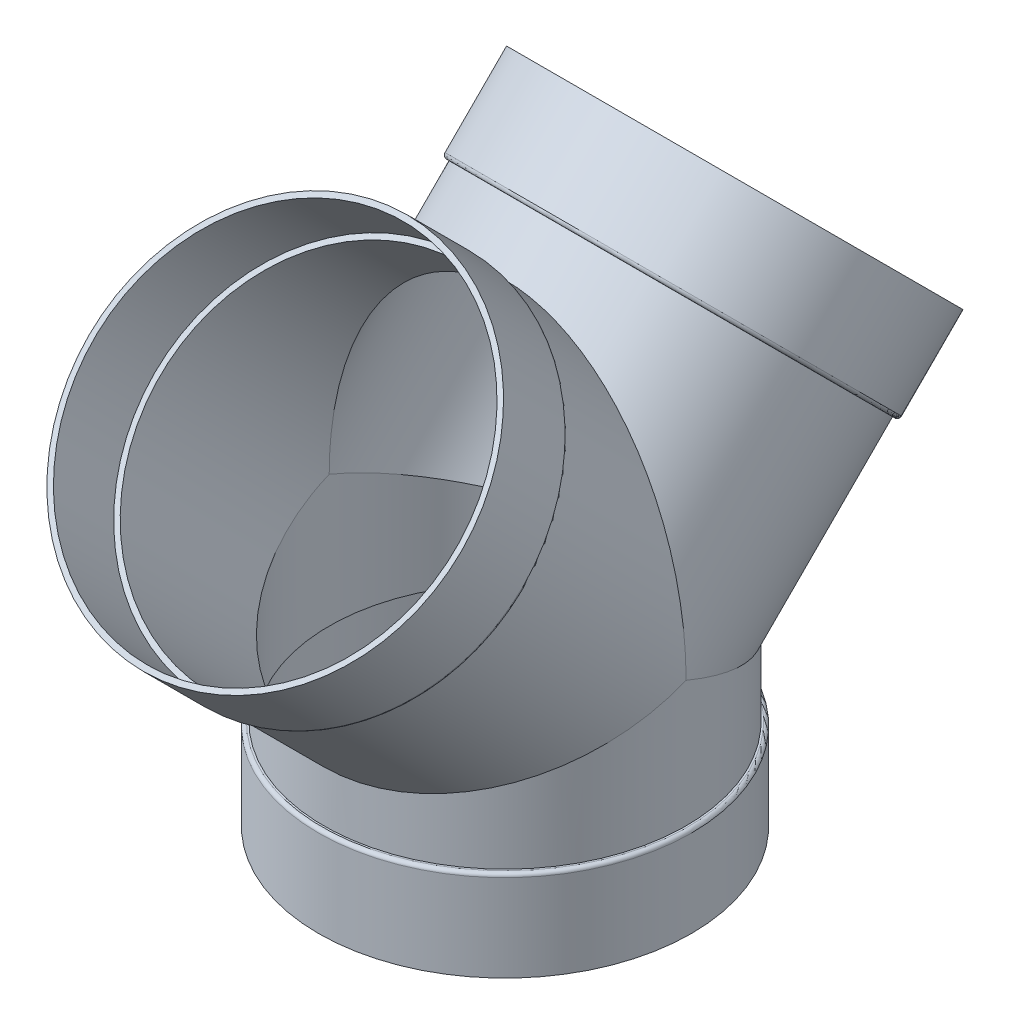
ISO-10303-21;
HEADER;
FILE_DESCRIPTION(('STEP AP214'),'2;1');
FILE_NAME('part.step','',(''),(''),'','','');
FILE_SCHEMA(('AUTOMOTIVE_DESIGN { 1 0 10303 214 1 1 1 1 }'));
ENDSEC;
DATA;
#1=APPLICATION_CONTEXT('core data for automotive mechanical design processes');
#2=APPLICATION_PROTOCOL_DEFINITION('international standard','automotive_design',2000,#1);
#3=PRODUCT_CONTEXT('',#1,'mechanical');
#4=PRODUCT('Part','Part','',(#3));
#5=PRODUCT_RELATED_PRODUCT_CATEGORY('part','',(#4));
#6=PRODUCT_DEFINITION_FORMATION('','',#4);
#7=PRODUCT_DEFINITION_CONTEXT('part definition',#1,'design');
#8=PRODUCT_DEFINITION('design','',#6,#7);
#9=PRODUCT_DEFINITION_SHAPE('','',#8);
#10=(LENGTH_UNIT() NAMED_UNIT(*) SI_UNIT(.MILLI.,.METRE.));
#11=(NAMED_UNIT(*) PLANE_ANGLE_UNIT() SI_UNIT($,.RADIAN.));
#12=(NAMED_UNIT(*) SI_UNIT($,.STERADIAN.) SOLID_ANGLE_UNIT());
#13=UNCERTAINTY_MEASURE_WITH_UNIT(LENGTH_MEASURE(1.E-05),#10,'distance_accuracy_value','');
#14=(GEOMETRIC_REPRESENTATION_CONTEXT(3) GLOBAL_UNCERTAINTY_ASSIGNED_CONTEXT((#13)) GLOBAL_UNIT_ASSIGNED_CONTEXT((#10,
#11,#12)) REPRESENTATION_CONTEXT('',''));
#15=CARTESIAN_POINT('',(0.,0.,0.));
#16=DIRECTION('',(0.,0.,1.));
#17=DIRECTION('',(1.,0.,0.));
#18=AXIS2_PLACEMENT_3D('',#15,#16,#17);
#19=CARTESIAN_POINT('',(0.,-52.1137931034483,0.));
#20=DIRECTION('',(0.,-1.,0.));
#21=DIRECTION('',(0.,0.,-1.));
#22=AXIS2_PLACEMENT_3D('',#19,#20,#21);
#23=CYLINDRICAL_SURFACE('',#22,161.925);
#24=CARTESIAN_POINT('',(0.,80.9625,0.));
#25=DIRECTION('',(0.,-1.,0.));
#26=DIRECTION('',(0.,0.,-1.));
#27=AXIS2_PLACEMENT_3D('',#24,#25,#26);
#28=CIRCLE('',#27,161.925);
#29=CARTESIAN_POINT('',(0.,80.9625,-161.925));
#30=VERTEX_POINT('',#29);
#31=EDGE_CURVE('E142',#30,#30,#28,.T.);
#32=ORIENTED_EDGE('',*,*,#31,.F.);
#33=EDGE_LOOP('',(#32));
#34=FACE_BOUND('',#33,.T.);
#35=CARTESIAN_POINT('',(0.,193.675,0.));
#36=DIRECTION('',(0.,0.923879532511286,-0.38268343236509));
#37=DIRECTION('',(0.,-0.382683432365091,-0.923879532511287));
#38=AXIS2_PLACEMENT_3D('',#35,#36,#37);
#39=ELLIPSE('',#38,175.266357032346,161.925);
#40=CARTESIAN_POINT('',(161.925,193.675,0.));
#41=VERTEX_POINT('',#40);
#42=CARTESIAN_POINT('',(-161.925,193.675,0.));
#43=VERTEX_POINT('',#42);
#44=EDGE_CURVE('E61',#41,#43,#39,.T.);
#45=ORIENTED_EDGE('',*,*,#44,.F.);
#46=CARTESIAN_POINT('',(0.,193.675,0.));
#47=DIRECTION('',(0.,0.923879532511286,0.38268343236509));
#48=DIRECTION('',(0.,-0.38268343236509,0.923879532511287));
#49=AXIS2_PLACEMENT_3D('',#46,#47,#48);
#50=ELLIPSE('',#49,175.266357032346,161.925);
#51=EDGE_CURVE('E148',#43,#41,#50,.T.);
#52=ORIENTED_EDGE('',*,*,#51,.F.);
#53=EDGE_LOOP('',(#45,#52));
#54=FACE_BOUND('',#53,.T.);
#55=ADVANCED_FACE('F43',(#34,#54),#23,.T.);
#56=CARTESIAN_POINT('',(0.,80.9625,166.6875));
#57=DIRECTION('',(0.,-1.,0.));
#58=DIRECTION('',(0.,0.,-1.));
#59=AXIS2_PLACEMENT_3D('',#56,#57,#58);
#60=PLANE('',#59);
#61=CARTESIAN_POINT('',(0.,80.9625,0.));
#62=DIRECTION('',(0.,-1.,0.));
#63=DIRECTION('',(0.,0.,-1.));
#64=AXIS2_PLACEMENT_3D('',#61,#62,#63);
#65=CIRCLE('',#64,163.5125);
#66=CARTESIAN_POINT('',(0.,80.9625,-163.5125));
#67=VERTEX_POINT('',#66);
#68=EDGE_CURVE('E158',#67,#67,#65,.F.);
#69=ORIENTED_EDGE('',*,*,#68,.T.);
#70=EDGE_LOOP('',(#69));
#71=FACE_BOUND('',#70,.T.);
#72=ORIENTED_EDGE('',*,*,#31,.T.);
#73=EDGE_LOOP('',(#72));
#74=FACE_BOUND('',#73,.T.);
#75=ADVANCED_FACE('F188',(#71,#74),#60,.F.);
#76=CARTESIAN_POINT('',(0.,-52.1137931034483,0.));
#77=DIRECTION('',(0.,-1.,0.));
#78=DIRECTION('',(0.,0.,-1.));
#79=AXIS2_PLACEMENT_3D('',#76,#77,#78);
#80=CYLINDRICAL_SURFACE('',#79,166.6875);
#81=CARTESIAN_POINT('',(0.,77.7875,0.));
#82=DIRECTION('',(0.,-1.,0.));
#83=DIRECTION('',(0.,0.,-1.));
#84=AXIS2_PLACEMENT_3D('',#81,#82,#83);
#85=CIRCLE('',#84,166.6875);
#86=CARTESIAN_POINT('',(0.,77.7875,-166.6875));
#87=VERTEX_POINT('',#86);
#88=EDGE_CURVE('E154',#87,#87,#85,.T.);
#89=ORIENTED_EDGE('',*,*,#88,.T.);
#90=EDGE_LOOP('',(#89));
#91=FACE_BOUND('',#90,.T.);
#92=CARTESIAN_POINT('',(0.,0.,0.));
#93=DIRECTION('',(0.,-1.,0.));
#94=DIRECTION('',(0.,0.,-1.));
#95=AXIS2_PLACEMENT_3D('',#92,#93,#94);
#96=CIRCLE('',#95,166.6875);
#97=CARTESIAN_POINT('',(0.,0.,-166.6875));
#98=VERTEX_POINT('',#97);
#99=EDGE_CURVE('E138',#98,#98,#96,.T.);
#100=ORIENTED_EDGE('',*,*,#99,.F.);
#101=EDGE_LOOP('',(#100));
#102=FACE_BOUND('',#101,.T.);
#103=ADVANCED_FACE('F194',(#91,#102),#80,.T.);
#104=CARTESIAN_POINT('',(0.,0.,166.6875));
#105=DIRECTION('',(0.,1.,0.));
#106=DIRECTION('',(0.,0.,1.));
#107=AXIS2_PLACEMENT_3D('',#104,#105,#106);
#108=PLANE('',#107);
#109=CARTESIAN_POINT('',(0.,0.,0.));
#110=DIRECTION('',(0.,1.,0.));
#111=DIRECTION('',(0.,0.,1.));
#112=AXIS2_PLACEMENT_3D('',#109,#110,#111);
#113=CIRCLE('',#112,161.925);
#114=CARTESIAN_POINT('',(0.,0.,161.925));
#115=VERTEX_POINT('',#114);
#116=EDGE_CURVE('E117',#115,#115,#113,.F.);
#117=ORIENTED_EDGE('',*,*,#116,.F.);
#118=EDGE_LOOP('',(#117));
#119=FACE_BOUND('',#118,.T.);
#120=ORIENTED_EDGE('',*,*,#99,.T.);
#121=EDGE_LOOP('',(#120));
#122=FACE_BOUND('',#121,.T.);
#123=ADVANCED_FACE('F215',(#119,#122),#108,.F.);
#124=CARTESIAN_POINT('',(0.,281.232497180424,-323.28922035849));
#125=DIRECTION('',(0.,0.707106781186547,-0.707106781186548));
#126=DIRECTION('',(0.,0.707106781186548,0.707106781186547));
#127=AXIS2_PLACEMENT_3D('',#124,#125,#126);
#128=PLANE('',#127);
#129=CARTESIAN_POINT('',(0.,399.098358769457,-205.423358769457));
#130=DIRECTION('',(0.,0.707106781186547,-0.707106781186548));
#131=DIRECTION('',(0.,0.707106781186548,0.707106781186547));
#132=AXIS2_PLACEMENT_3D('',#129,#130,#131);
#133=CIRCLE('',#132,161.925);
#134=CARTESIAN_POINT('',(0.,513.596624313088,-90.9250932258256));
#135=VERTEX_POINT('',#134);
#136=EDGE_CURVE('E108',#135,#135,#133,.F.);
#137=ORIENTED_EDGE('',*,*,#136,.T.);
#138=EDGE_LOOP('',(#137));
#139=FACE_BOUND('',#138,.T.);
#140=CARTESIAN_POINT('',(0.,399.098358769457,-205.423358769457));
#141=DIRECTION('',(0.,-0.707106781186547,0.707106781186548));
#142=DIRECTION('',(0.,-0.707106781186548,-0.707106781186547));
#143=AXIS2_PLACEMENT_3D('',#140,#141,#142);
#144=CIRCLE('',#143,166.6875);
#145=CARTESIAN_POINT('',(0.,281.232497180424,-323.28922035849));
#146=VERTEX_POINT('',#145);
#147=EDGE_CURVE('E134',#146,#146,#144,.T.);
#148=ORIENTED_EDGE('',*,*,#147,.F.);
#149=EDGE_LOOP('',(#148));
#150=FACE_BOUND('',#149,.T.);
#151=ADVANCED_FACE('F219',(#139,#150),#128,.T.);
#152=CARTESIAN_POINT('',(0.,399.098358769457,-205.423358769457));
#153=DIRECTION('',(0.,-0.707106781186547,0.707106781186548));
#154=DIRECTION('',(0.,-0.707106781186548,-0.707106781186547));
#155=AXIS2_PLACEMENT_3D('',#152,#153,#154);
#156=CYLINDRICAL_SURFACE('',#155,166.6875);
#157=CARTESIAN_POINT('',(0.,344.094290027908,-150.419290027909));
#158=DIRECTION('',(0.,-0.707106781186547,0.707106781186548));
#159=DIRECTION('',(0.,-0.707106781186548,-0.707106781186547));
#160=AXIS2_PLACEMENT_3D('',#157,#158,#159);
#161=CIRCLE('',#160,166.6875);
#162=CARTESIAN_POINT('',(0.,226.228428438875,-268.285151616941));
#163=VERTEX_POINT('',#162);
#164=EDGE_CURVE('E166',#163,#163,#161,.F.);
#165=ORIENTED_EDGE('',*,*,#164,.T.);
#166=EDGE_LOOP('',(#165));
#167=FACE_BOUND('',#166,.T.);
#168=ORIENTED_EDGE('',*,*,#147,.T.);
#169=EDGE_LOOP('',(#168));
#170=FACE_BOUND('',#169,.T.);
#171=ADVANCED_FACE('F225',(#167,#170),#156,.T.);
#172=CARTESIAN_POINT('',(0.,227.350960454009,-262.672491541273));
#173=DIRECTION('',(0.,-0.707106781186547,0.707106781186548));
#174=DIRECTION('',(0.,-0.707106781186548,-0.707106781186547));
#175=AXIS2_PLACEMENT_3D('',#172,#173,#174);
#176=PLANE('',#175);
#177=CARTESIAN_POINT('',(0.,341.849225997641,-148.174225997641));
#178=DIRECTION('',(0.,-0.707106781186547,0.707106781186548));
#179=DIRECTION('',(0.,-0.707106781186548,-0.707106781186547));
#180=AXIS2_PLACEMENT_3D('',#177,#178,#179);
#181=CIRCLE('',#180,163.5125);
#182=CARTESIAN_POINT('',(0.,226.228428438875,-263.795023556407));
#183=VERTEX_POINT('',#182);
#184=EDGE_CURVE('E162',#183,#183,#181,.T.);
#185=ORIENTED_EDGE('',*,*,#184,.T.);
#186=EDGE_LOOP('',(#185));
#187=FACE_BOUND('',#186,.T.);
#188=CARTESIAN_POINT('',(0.,341.849225997641,-148.174225997641));
#189=DIRECTION('',(0.,-0.707106781186547,0.707106781186548));
#190=DIRECTION('',(0.,-0.707106781186548,-0.707106781186547));
#191=AXIS2_PLACEMENT_3D('',#188,#189,#190);
#192=CIRCLE('',#191,161.925);
#193=CARTESIAN_POINT('',(0.,227.350960454009,-262.672491541273));
#194=VERTEX_POINT('',#193);
#195=EDGE_CURVE('E130',#194,#194,#192,.T.);
#196=ORIENTED_EDGE('',*,*,#195,.F.);
#197=EDGE_LOOP('',(#196));
#198=FACE_BOUND('',#197,.T.);
#199=ADVANCED_FACE('F232',(#187,#198),#176,.T.);
#200=CARTESIAN_POINT('',(0.,399.098358769457,-205.423358769457));
#201=DIRECTION('',(0.,-0.707106781186547,0.707106781186548));
#202=DIRECTION('',(0.,-0.707106781186548,-0.707106781186547));
#203=AXIS2_PLACEMENT_3D('',#200,#201,#202);
#204=CYLINDRICAL_SURFACE('',#203,161.925);
#205=CARTESIAN_POINT('',(0.,193.675,0.));
#206=DIRECTION('',(0.,0.,1.));
#207=DIRECTION('',(0.,-1.,0.));
#208=AXIS2_PLACEMENT_3D('',#205,#206,#207);
#209=ELLIPSE('',#208,228.996531087263,161.925);
#210=EDGE_CURVE('E58',#41,#43,#209,.T.);
#211=ORIENTED_EDGE('',*,*,#210,.F.);
#212=ORIENTED_EDGE('',*,*,#44,.T.);
#213=EDGE_LOOP('',(#211,#212));
#214=FACE_BOUND('',#213,.T.);
#215=ORIENTED_EDGE('',*,*,#195,.T.);
#216=EDGE_LOOP('',(#215));
#217=FACE_BOUND('',#216,.T.);
#218=ADVANCED_FACE('F236',(#214,#217),#204,.T.);
#219=CARTESIAN_POINT('',(0.,281.232497180424,323.28922035849));
#220=DIRECTION('',(0.,0.707106781186547,0.707106781186548));
#221=DIRECTION('',(0.,0.707106781186548,-0.707106781186547));
#222=AXIS2_PLACEMENT_3D('',#219,#220,#221);
#223=PLANE('',#222);
#224=CARTESIAN_POINT('',(0.,399.098358769457,205.423358769457));
#225=DIRECTION('',(0.,0.707106781186547,0.707106781186548));
#226=DIRECTION('',(0.,-0.707106781186548,0.707106781186547));
#227=AXIS2_PLACEMENT_3D('',#224,#225,#226);
#228=CIRCLE('',#227,161.925);
#229=CARTESIAN_POINT('',(0.,284.600093225825,319.921624313089));
#230=VERTEX_POINT('',#229);
#231=EDGE_CURVE('E104',#230,#230,#228,.T.);
#232=ORIENTED_EDGE('',*,*,#231,.F.);
#233=EDGE_LOOP('',(#232));
#234=FACE_BOUND('',#233,.T.);
#235=CARTESIAN_POINT('',(0.,399.098358769457,205.423358769457));
#236=DIRECTION('',(0.,0.707106781186547,0.707106781186548));
#237=DIRECTION('',(0.,-0.707106781186548,0.707106781186547));
#238=AXIS2_PLACEMENT_3D('',#235,#236,#237);
#239=CIRCLE('',#238,166.6875);
#240=CARTESIAN_POINT('',(0.,281.232497180424,323.28922035849));
#241=VERTEX_POINT('',#240);
#242=EDGE_CURVE('E94',#241,#241,#239,.T.);
#243=ORIENTED_EDGE('',*,*,#242,.T.);
#244=EDGE_LOOP('',(#243));
#245=FACE_BOUND('',#244,.T.);
#246=ADVANCED_FACE('F240',(#234,#245),#223,.T.);
#247=CARTESIAN_POINT('',(0.,399.098358769457,205.423358769457));
#248=DIRECTION('',(0.,-0.707106781186547,-0.707106781186548));
#249=DIRECTION('',(0.,-0.707106781186548,0.707106781186547));
#250=AXIS2_PLACEMENT_3D('',#247,#248,#249);
#251=CYLINDRICAL_SURFACE('',#250,166.6875);
#252=CARTESIAN_POINT('',(0.,344.094290027908,150.419290027909));
#253=DIRECTION('',(0.,-0.707106781186547,-0.707106781186548));
#254=DIRECTION('',(0.,0.707106781186548,-0.707106781186547));
#255=AXIS2_PLACEMENT_3D('',#252,#253,#254);
#256=CIRCLE('',#255,166.6875);
#257=CARTESIAN_POINT('',(0.,461.960151616941,32.553428438876));
#258=VERTEX_POINT('',#257);
#259=EDGE_CURVE('E52',#258,#258,#256,.F.);
#260=ORIENTED_EDGE('',*,*,#259,.T.);
#261=EDGE_LOOP('',(#260));
#262=FACE_BOUND('',#261,.T.);
#263=ORIENTED_EDGE('',*,*,#242,.F.);
#264=EDGE_LOOP('',(#263));
#265=FACE_BOUND('',#264,.T.);
#266=ADVANCED_FACE('F175',(#262,#265),#251,.T.);
#267=CARTESIAN_POINT('',(0.,227.350960454009,262.672491541273));
#268=DIRECTION('',(0.,-0.707106781186547,-0.707106781186548));
#269=DIRECTION('',(0.,-0.707106781186548,0.707106781186547));
#270=AXIS2_PLACEMENT_3D('',#267,#268,#269);
#271=PLANE('',#270);
#272=CARTESIAN_POINT('',(0.,341.849225997641,148.174225997641));
#273=DIRECTION('',(0.,-0.707106781186547,-0.707106781186548));
#274=DIRECTION('',(0.,0.707106781186548,-0.707106781186547));
#275=AXIS2_PLACEMENT_3D('',#272,#273,#274);
#276=CIRCLE('',#275,163.5125);
#277=CARTESIAN_POINT('',(0.,457.470023556406,32.553428438876));
#278=VERTEX_POINT('',#277);
#279=EDGE_CURVE('E11',#278,#278,#276,.T.);
#280=ORIENTED_EDGE('',*,*,#279,.T.);
#281=EDGE_LOOP('',(#280));
#282=FACE_BOUND('',#281,.T.);
#283=CARTESIAN_POINT('',(0.,341.849225997641,148.174225997641));
#284=DIRECTION('',(0.,0.707106781186547,0.707106781186548));
#285=DIRECTION('',(0.,-0.707106781186548,0.707106781186547));
#286=AXIS2_PLACEMENT_3D('',#283,#284,#285);
#287=CIRCLE('',#286,161.925);
#288=CARTESIAN_POINT('',(0.,227.350960454009,262.672491541273));
#289=VERTEX_POINT('',#288);
#290=EDGE_CURVE('E88',#289,#289,#287,.T.);
#291=ORIENTED_EDGE('',*,*,#290,.T.);
#292=EDGE_LOOP('',(#291));
#293=FACE_BOUND('',#292,.T.);
#294=ADVANCED_FACE('F246',(#282,#293),#271,.T.);
#295=CARTESIAN_POINT('',(0.,399.098358769457,205.423358769457));
#296=DIRECTION('',(0.,-0.707106781186547,-0.707106781186548));
#297=DIRECTION('',(0.,-0.707106781186548,0.707106781186547));
#298=AXIS2_PLACEMENT_3D('',#295,#296,#297);
#299=CYLINDRICAL_SURFACE('',#298,161.925);
#300=ORIENTED_EDGE('',*,*,#290,.F.);
#301=EDGE_LOOP('',(#300));
#302=FACE_BOUND('',#301,.T.);
#303=ORIENTED_EDGE('',*,*,#210,.T.);
#304=ORIENTED_EDGE('',*,*,#51,.T.);
#305=EDGE_LOOP('',(#303,#304));
#306=FACE_BOUND('',#305,.T.);
#307=ADVANCED_FACE('F249',(#302,#306),#299,.T.);
#308=CARTESIAN_POINT('',(0.,-52.1137931034483,0.));
#309=DIRECTION('',(0.,-1.,0.));
#310=DIRECTION('',(0.,0.,-1.));
#311=AXIS2_PLACEMENT_3D('',#308,#309,#310);
#312=CYLINDRICAL_SURFACE('',#311,157.1625);
#313=CARTESIAN_POINT('',(0.,76.2,0.));
#314=DIRECTION('',(0.,-1.,0.));
#315=DIRECTION('',(0.,0.,-1.));
#316=AXIS2_PLACEMENT_3D('',#313,#314,#315);
#317=CIRCLE('',#316,157.1625);
#318=CARTESIAN_POINT('',(0.,76.2,-157.1625));
#319=VERTEX_POINT('',#318);
#320=EDGE_CURVE('E78',#319,#319,#317,.T.);
#321=ORIENTED_EDGE('',*,*,#320,.T.);
#322=EDGE_LOOP('',(#321));
#323=FACE_BOUND('',#322,.T.);
#324=CARTESIAN_POINT('',(0.,193.675,0.));
#325=DIRECTION('',(0.,-0.923879532511287,0.38268343236509));
#326=DIRECTION('',(0.,0.38268343236509,0.923879532511287));
#327=AXIS2_PLACEMENT_3D('',#324,#325,#326);
#328=ELLIPSE('',#327,170.111464178453,157.1625);
#329=CARTESIAN_POINT('',(157.1625,193.675,0.));
#330=VERTEX_POINT('',#329);
#331=CARTESIAN_POINT('',(-157.1625,193.675,0.));
#332=VERTEX_POINT('',#331);
#333=EDGE_CURVE('E71',#330,#332,#328,.F.);
#334=ORIENTED_EDGE('',*,*,#333,.T.);
#335=CARTESIAN_POINT('',(0.,193.675,0.));
#336=DIRECTION('',(0.,-0.923879532511287,-0.38268343236509));
#337=DIRECTION('',(0.,0.38268343236509,-0.923879532511287));
#338=AXIS2_PLACEMENT_3D('',#335,#336,#337);
#339=ELLIPSE('',#338,170.111464178453,157.1625);
#340=EDGE_CURVE('E74',#332,#330,#339,.F.);
#341=ORIENTED_EDGE('',*,*,#340,.T.);
#342=EDGE_LOOP('',(#334,#341));
#343=FACE_BOUND('',#342,.T.);
#344=ADVANCED_FACE('F73',(#323,#343),#312,.F.);
#345=CARTESIAN_POINT('',(0.,76.2,166.6875));
#346=DIRECTION('',(0.,-1.,0.));
#347=DIRECTION('',(0.,0.,-1.));
#348=AXIS2_PLACEMENT_3D('',#345,#346,#347);
#349=PLANE('',#348);
#350=CARTESIAN_POINT('',(0.,76.2,0.));
#351=DIRECTION('',(0.,-1.,0.));
#352=DIRECTION('',(0.,0.,-1.));
#353=AXIS2_PLACEMENT_3D('',#350,#351,#352);
#354=CIRCLE('',#353,161.925);
#355=CARTESIAN_POINT('',(0.,76.2,-161.925));
#356=VERTEX_POINT('',#355);
#357=EDGE_CURVE('E98',#356,#356,#354,.T.);
#358=ORIENTED_EDGE('',*,*,#357,.T.);
#359=EDGE_LOOP('',(#358));
#360=FACE_BOUND('',#359,.T.);
#361=ORIENTED_EDGE('',*,*,#320,.F.);
#362=EDGE_LOOP('',(#361));
#363=FACE_BOUND('',#362,.T.);
#364=ADVANCED_FACE('F274',(#360,#363),#349,.T.);
#365=CARTESIAN_POINT('',(0.,-52.1137931034483,0.));
#366=DIRECTION('',(0.,-1.,0.));
#367=DIRECTION('',(0.,0.,-1.));
#368=AXIS2_PLACEMENT_3D('',#365,#366,#367);
#369=CYLINDRICAL_SURFACE('',#368,161.925);
#370=ORIENTED_EDGE('',*,*,#116,.T.);
#371=EDGE_LOOP('',(#370));
#372=FACE_BOUND('',#371,.T.);
#373=ORIENTED_EDGE('',*,*,#357,.F.);
#374=EDGE_LOOP('',(#373));
#375=FACE_BOUND('',#374,.T.);
#376=ADVANCED_FACE('F270',(#372,#375),#369,.F.);
#377=CARTESIAN_POINT('',(0.,399.098358769457,-205.423358769457));
#378=DIRECTION('',(0.,-0.707106781186547,0.707106781186548));
#379=DIRECTION('',(0.,-0.707106781186548,-0.707106781186547));
#380=AXIS2_PLACEMENT_3D('',#377,#378,#379);
#381=CYLINDRICAL_SURFACE('',#380,161.925);
#382=ORIENTED_EDGE('',*,*,#136,.F.);
#383=EDGE_LOOP('',(#382));
#384=FACE_BOUND('',#383,.T.);
#385=CARTESIAN_POINT('',(0.,345.216822043042,-151.541822043042));
#386=DIRECTION('',(0.,-0.707106781186547,0.707106781186548));
#387=DIRECTION('',(0.,-0.707106781186548,-0.707106781186547));
#388=AXIS2_PLACEMENT_3D('',#385,#386,#387);
#389=CIRCLE('',#388,161.925);
#390=CARTESIAN_POINT('',(0.,230.71855649941,-266.040087586674));
#391=VERTEX_POINT('',#390);
#392=EDGE_CURVE('E103',#391,#391,#389,.T.);
#393=ORIENTED_EDGE('',*,*,#392,.T.);
#394=EDGE_LOOP('',(#393));
#395=FACE_BOUND('',#394,.T.);
#396=ADVANCED_FACE('F266',(#384,#395),#381,.F.);
#397=CARTESIAN_POINT('',(0.,230.71855649941,-266.040087586674));
#398=DIRECTION('',(0.,-0.707106781186547,0.707106781186548));
#399=DIRECTION('',(0.,-0.707106781186548,-0.707106781186547));
#400=AXIS2_PLACEMENT_3D('',#397,#398,#399);
#401=PLANE('',#400);
#402=ORIENTED_EDGE('',*,*,#392,.F.);
#403=EDGE_LOOP('',(#402));
#404=FACE_BOUND('',#403,.T.);
#405=CARTESIAN_POINT('',(0.,345.216822043042,-151.541822043042));
#406=DIRECTION('',(0.,-0.707106781186547,0.707106781186548));
#407=DIRECTION('',(0.,-0.707106781186548,-0.707106781186547));
#408=AXIS2_PLACEMENT_3D('',#405,#406,#407);
#409=CIRCLE('',#408,157.1625);
#410=CARTESIAN_POINT('',(0.,234.086152544811,-262.672491541273));
#411=VERTEX_POINT('',#410);
#412=EDGE_CURVE('E99',#411,#411,#409,.T.);
#413=ORIENTED_EDGE('',*,*,#412,.T.);
#414=EDGE_LOOP('',(#413));
#415=FACE_BOUND('',#414,.T.);
#416=ADVANCED_FACE('F263',(#404,#415),#401,.F.);
#417=CARTESIAN_POINT('',(0.,399.098358769457,-205.423358769457));
#418=DIRECTION('',(0.,-0.707106781186547,0.707106781186548));
#419=DIRECTION('',(0.,-0.707106781186548,-0.707106781186547));
#420=AXIS2_PLACEMENT_3D('',#417,#418,#419);
#421=CYLINDRICAL_SURFACE('',#420,157.1625);
#422=CARTESIAN_POINT('',(0.,193.675,0.));
#423=DIRECTION('',(0.,0.,1.));
#424=DIRECTION('',(0.,-1.,0.));
#425=AXIS2_PLACEMENT_3D('',#422,#423,#424);
#426=ELLIPSE('',#425,222.261338996461,157.1625);
#427=EDGE_CURVE('E82',#330,#332,#426,.T.);
#428=ORIENTED_EDGE('',*,*,#427,.T.);
#429=ORIENTED_EDGE('',*,*,#333,.F.);
#430=EDGE_LOOP('',(#428,#429));
#431=FACE_BOUND('',#430,.T.);
#432=ORIENTED_EDGE('',*,*,#412,.F.);
#433=EDGE_LOOP('',(#432));
#434=FACE_BOUND('',#433,.T.);
#435=ADVANCED_FACE('F85',(#431,#434),#421,.F.);
#436=CARTESIAN_POINT('',(0.,399.098358769457,205.423358769457));
#437=DIRECTION('',(0.,-0.707106781186547,-0.707106781186548));
#438=DIRECTION('',(0.,-0.707106781186548,0.707106781186547));
#439=AXIS2_PLACEMENT_3D('',#436,#437,#438);
#440=CYLINDRICAL_SURFACE('',#439,161.925);
#441=ORIENTED_EDGE('',*,*,#231,.T.);
#442=EDGE_LOOP('',(#441));
#443=FACE_BOUND('',#442,.T.);
#444=CARTESIAN_POINT('',(0.,345.216822043042,151.541822043042));
#445=DIRECTION('',(0.,-0.707106781186547,-0.707106781186548));
#446=DIRECTION('',(0.,0.707106781186548,-0.707106781186547));
#447=AXIS2_PLACEMENT_3D('',#444,#445,#446);
#448=CIRCLE('',#447,161.925);
#449=CARTESIAN_POINT('',(0.,459.715087586674,37.0435564994105));
#450=VERTEX_POINT('',#449);
#451=EDGE_CURVE('E113',#450,#450,#448,.F.);
#452=ORIENTED_EDGE('',*,*,#451,.F.);
#453=EDGE_LOOP('',(#452));
#454=FACE_BOUND('',#453,.T.);
#455=ADVANCED_FACE('F256',(#443,#454),#440,.F.);
#456=CARTESIAN_POINT('',(0.,230.71855649941,266.040087586674));
#457=DIRECTION('',(0.,-0.707106781186547,-0.707106781186548));
#458=DIRECTION('',(0.,-0.707106781186548,0.707106781186547));
#459=AXIS2_PLACEMENT_3D('',#456,#457,#458);
#460=PLANE('',#459);
#461=ORIENTED_EDGE('',*,*,#451,.T.);
#462=EDGE_LOOP('',(#461));
#463=FACE_BOUND('',#462,.T.);
#464=CARTESIAN_POINT('',(0.,345.216822043042,151.541822043042));
#465=DIRECTION('',(0.,-0.707106781186547,-0.707106781186548));
#466=DIRECTION('',(0.,0.707106781186548,-0.707106781186547));
#467=AXIS2_PLACEMENT_3D('',#464,#465,#466);
#468=CIRCLE('',#467,157.1625);
#469=CARTESIAN_POINT('',(0.,456.347491541272,40.4111525448116));
#470=VERTEX_POINT('',#469);
#471=EDGE_CURVE('E109',#470,#470,#468,.F.);
#472=ORIENTED_EDGE('',*,*,#471,.F.);
#473=EDGE_LOOP('',(#472));
#474=FACE_BOUND('',#473,.T.);
#475=ADVANCED_FACE('F206',(#463,#474),#460,.F.);
#476=CARTESIAN_POINT('',(0.,399.098358769457,205.423358769457));
#477=DIRECTION('',(0.,-0.707106781186547,-0.707106781186548));
#478=DIRECTION('',(0.,-0.707106781186548,0.707106781186547));
#479=AXIS2_PLACEMENT_3D('',#476,#477,#478);
#480=CYLINDRICAL_SURFACE('',#479,157.1625);
#481=ORIENTED_EDGE('',*,*,#471,.T.);
#482=EDGE_LOOP('',(#481));
#483=FACE_BOUND('',#482,.T.);
#484=ORIENTED_EDGE('',*,*,#427,.F.);
#485=ORIENTED_EDGE('',*,*,#340,.F.);
#486=EDGE_LOOP('',(#484,#485));
#487=FACE_BOUND('',#486,.T.);
#488=ADVANCED_FACE('F81',(#483,#487),#480,.F.);
#489=CARTESIAN_POINT('',(0.,77.7875,0.));
#490=DIRECTION('',(0.,-1.,0.));
#491=DIRECTION('',(0.,0.,-1.));
#492=AXIS2_PLACEMENT_3D('',#489,#490,#491);
#493=TOROIDAL_SURFACE('',#492,163.5125,3.175);
#494=ORIENTED_EDGE('',*,*,#68,.F.);
#495=EDGE_LOOP('',(#494));
#496=FACE_BOUND('',#495,.T.);
#497=ORIENTED_EDGE('',*,*,#88,.F.);
#498=EDGE_LOOP('',(#497));
#499=FACE_BOUND('',#498,.T.);
#500=ADVANCED_FACE('F184',(#496,#499),#493,.T.);
#501=CARTESIAN_POINT('',(0.,344.094290027908,-150.419290027909));
#502=DIRECTION('',(0.,-0.707106781186547,0.707106781186548));
#503=DIRECTION('',(0.,-0.707106781186548,-0.707106781186547));
#504=AXIS2_PLACEMENT_3D('',#501,#502,#503);
#505=TOROIDAL_SURFACE('',#504,163.5125,3.175);
#506=ORIENTED_EDGE('',*,*,#164,.F.);
#507=EDGE_LOOP('',(#506));
#508=FACE_BOUND('',#507,.T.);
#509=ORIENTED_EDGE('',*,*,#184,.F.);
#510=EDGE_LOOP('',(#509));
#511=FACE_BOUND('',#510,.T.);
#512=ADVANCED_FACE('F179',(#508,#511),#505,.T.);
#513=CARTESIAN_POINT('',(0.,344.094290027908,150.419290027909));
#514=DIRECTION('',(0.,-0.707106781186547,-0.707106781186548));
#515=DIRECTION('',(0.,0.707106781186548,-0.707106781186547));
#516=AXIS2_PLACEMENT_3D('',#513,#514,#515);
#517=TOROIDAL_SURFACE('',#516,163.5125,3.175);
#518=ORIENTED_EDGE('',*,*,#279,.F.);
#519=EDGE_LOOP('',(#518));
#520=FACE_BOUND('',#519,.T.);
#521=ORIENTED_EDGE('',*,*,#259,.F.);
#522=EDGE_LOOP('',(#521));
#523=FACE_BOUND('',#522,.T.);
#524=ADVANCED_FACE('F45',(#520,#523),#517,.T.);
#525=CLOSED_SHELL('',(#55,#75,#103,#123,#151,#171,#199,#218,#246,#266,#294,#307,#344,#364,#376,
#396,#416,#435,#455,#475,#488,#500,#512,#524));
#526=MANIFOLD_SOLID_BREP('B2',#525);
#527=ADVANCED_BREP_SHAPE_REPRESENTATION('',(#18,#526),#14);
#528=SHAPE_DEFINITION_REPRESENTATION(#9,#527);
ENDSEC;
END-ISO-10303-21;
